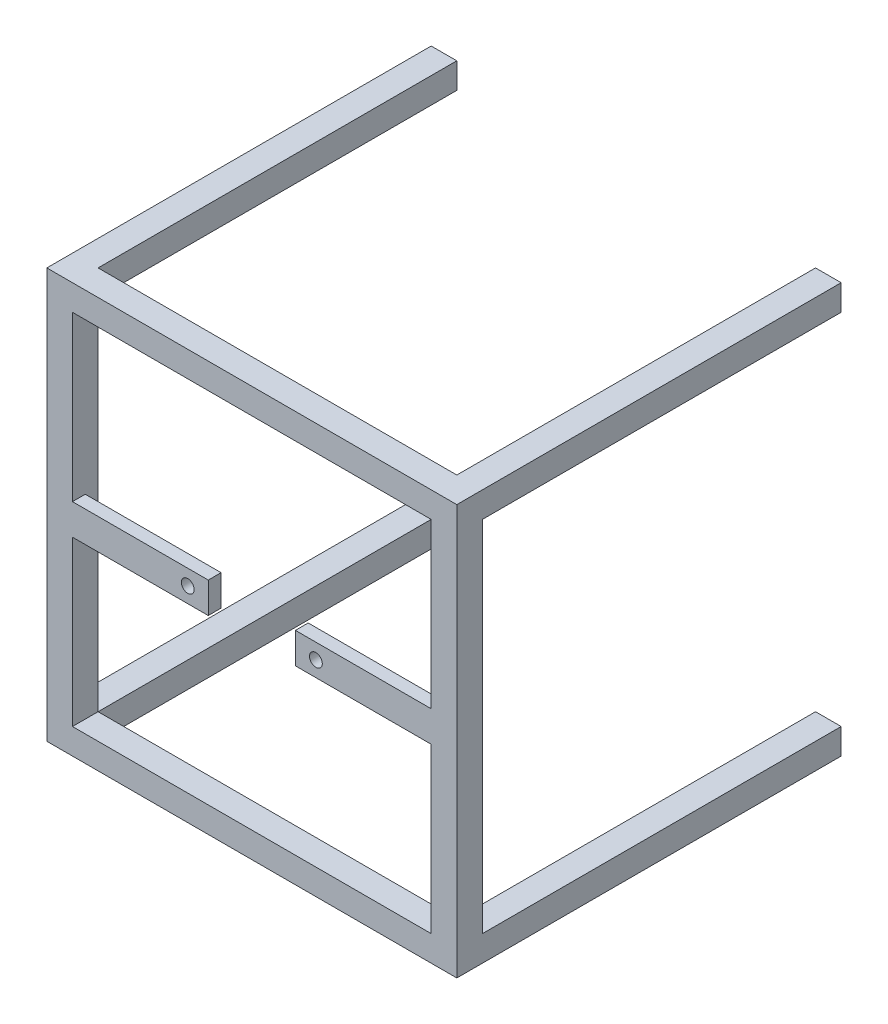
ISO-10303-21;
HEADER;
FILE_DESCRIPTION(('STEP AP214'),'2;1');
FILE_NAME('part.step','',(''),(''),'','','');
FILE_SCHEMA(('AUTOMOTIVE_DESIGN { 1 0 10303 214 1 1 1 1 }'));
ENDSEC;
DATA;
#1=APPLICATION_CONTEXT('core data for automotive mechanical design processes');
#2=APPLICATION_PROTOCOL_DEFINITION('international standard','automotive_design',2000,#1);
#3=PRODUCT_CONTEXT('',#1,'mechanical');
#4=PRODUCT('Part','Part','',(#3));
#5=PRODUCT_RELATED_PRODUCT_CATEGORY('part','',(#4));
#6=PRODUCT_DEFINITION_FORMATION('','',#4);
#7=PRODUCT_DEFINITION_CONTEXT('part definition',#1,'design');
#8=PRODUCT_DEFINITION('design','',#6,#7);
#9=PRODUCT_DEFINITION_SHAPE('','',#8);
#10=(LENGTH_UNIT() NAMED_UNIT(*) SI_UNIT(.MILLI.,.METRE.));
#11=(NAMED_UNIT(*) PLANE_ANGLE_UNIT() SI_UNIT($,.RADIAN.));
#12=(NAMED_UNIT(*) SI_UNIT($,.STERADIAN.) SOLID_ANGLE_UNIT());
#13=UNCERTAINTY_MEASURE_WITH_UNIT(LENGTH_MEASURE(1.E-05),#10,'distance_accuracy_value','');
#14=(GEOMETRIC_REPRESENTATION_CONTEXT(3) GLOBAL_UNCERTAINTY_ASSIGNED_CONTEXT((#13)) GLOBAL_UNIT_ASSIGNED_CONTEXT((#10,
#11,#12)) REPRESENTATION_CONTEXT('',''));
#15=CARTESIAN_POINT('',(0.,0.,0.));
#16=DIRECTION('',(0.,0.,1.));
#17=DIRECTION('',(1.,0.,0.));
#18=AXIS2_PLACEMENT_3D('',#15,#16,#17);
#19=CARTESIAN_POINT('',(0.,0.,10.));
#20=DIRECTION('',(1.,0.,0.));
#21=DIRECTION('',(0.,1.,0.));
#22=AXIS2_PLACEMENT_3D('',#19,#20,#21);
#23=PLANE('',#22);
#24=DIRECTION('',(0.,0.,-1.));
#25=VECTOR('',#24,1.);
#26=CARTESIAN_POINT('',(0.,0.,10.));
#27=LINE('',#26,#25);
#28=CARTESIAN_POINT('',(0.,0.,160.));
#29=VERTEX_POINT('',#28);
#30=CARTESIAN_POINT('',(0.,0.,10.));
#31=VERTEX_POINT('',#30);
#32=EDGE_CURVE('E248',#29,#31,#27,.T.);
#33=ORIENTED_EDGE('',*,*,#32,.T.);
#34=DIRECTION('',(0.,1.,0.));
#35=VECTOR('',#34,1.);
#36=CARTESIAN_POINT('',(0.,0.,10.));
#37=LINE('',#36,#35);
#38=CARTESIAN_POINT('',(0.,-10.,10.));
#39=VERTEX_POINT('',#38);
#40=EDGE_CURVE('E511',#39,#31,#37,.T.);
#41=ORIENTED_EDGE('',*,*,#40,.F.);
#42=DIRECTION('',(0.,0.,1.));
#43=VECTOR('',#42,1.);
#44=CARTESIAN_POINT('',(0.,-10.,0.));
#45=LINE('',#44,#43);
#46=CARTESIAN_POINT('',(0.,-10.,150.));
#47=VERTEX_POINT('',#46);
#48=EDGE_CURVE('E490',#39,#47,#45,.T.);
#49=ORIENTED_EDGE('',*,*,#48,.T.);
#50=DIRECTION('',(0.,-1.,0.));
#51=VECTOR('',#50,1.);
#52=CARTESIAN_POINT('',(0.,0.,150.));
#53=LINE('',#52,#51);
#54=CARTESIAN_POINT('',(0.,-150.,150.));
#55=VERTEX_POINT('',#54);
#56=EDGE_CURVE('E383',#47,#55,#53,.T.);
#57=ORIENTED_EDGE('',*,*,#56,.T.);
#58=DIRECTION('',(0.,0.,1.));
#59=VECTOR('',#58,1.);
#60=CARTESIAN_POINT('',(0.,-150.,0.));
#61=LINE('',#60,#59);
#62=CARTESIAN_POINT('',(0.,-150.,10.));
#63=VERTEX_POINT('',#62);
#64=EDGE_CURVE('E424',#63,#55,#61,.T.);
#65=ORIENTED_EDGE('',*,*,#64,.F.);
#66=CARTESIAN_POINT('',(0.,-160.,10.));
#67=VERTEX_POINT('',#66);
#68=EDGE_CURVE('E829',#67,#63,#37,.T.);
#69=ORIENTED_EDGE('',*,*,#68,.F.);
#70=DIRECTION('',(0.,0.,-1.));
#71=VECTOR('',#70,1.);
#72=CARTESIAN_POINT('',(0.,-160.,10.));
#73=LINE('',#72,#71);
#74=CARTESIAN_POINT('',(0.,-160.,160.));
#75=VERTEX_POINT('',#74);
#76=EDGE_CURVE('E240',#75,#67,#73,.T.);
#77=ORIENTED_EDGE('',*,*,#76,.F.);
#78=DIRECTION('',(0.,-1.,0.));
#79=VECTOR('',#78,1.);
#80=CARTESIAN_POINT('',(0.,0.,160.));
#81=LINE('',#80,#79);
#82=EDGE_CURVE('E384',#29,#75,#81,.T.);
#83=ORIENTED_EDGE('',*,*,#82,.F.);
#84=EDGE_LOOP('',(#33,#41,#49,#57,#65,#69,#77,#83));
#85=FACE_BOUND('',#84,.T.);
#86=ADVANCED_FACE('F39',(#85),#23,.F.);
#87=CARTESIAN_POINT('',(0.,-160.,10.));
#88=DIRECTION('',(0.,1.,0.));
#89=DIRECTION('',(0.,0.,1.));
#90=AXIS2_PLACEMENT_3D('',#87,#88,#89);
#91=PLANE('',#90);
#92=ORIENTED_EDGE('',*,*,#76,.T.);
#93=DIRECTION('',(-1.,0.,0.));
#94=VECTOR('',#93,1.);
#95=CARTESIAN_POINT('',(160.,-160.,10.));
#96=LINE('',#95,#94);
#97=CARTESIAN_POINT('',(10.,-160.,10.));
#98=VERTEX_POINT('',#97);
#99=EDGE_CURVE('E221',#98,#67,#96,.T.);
#100=ORIENTED_EDGE('',*,*,#99,.F.);
#101=DIRECTION('',(0.,0.,1.));
#102=VECTOR('',#101,1.);
#103=CARTESIAN_POINT('',(10.,-160.,0.));
#104=LINE('',#103,#102);
#105=CARTESIAN_POINT('',(10.,-160.,150.));
#106=VERTEX_POINT('',#105);
#107=EDGE_CURVE('E419',#98,#106,#104,.T.);
#108=ORIENTED_EDGE('',*,*,#107,.T.);
#109=DIRECTION('',(1.,0.,0.));
#110=VECTOR('',#109,1.);
#111=CARTESIAN_POINT('',(0.,-160.,150.));
#112=LINE('',#111,#110);
#113=CARTESIAN_POINT('',(150.,-160.,150.));
#114=VERTEX_POINT('',#113);
#115=EDGE_CURVE('E401',#106,#114,#112,.T.);
#116=ORIENTED_EDGE('',*,*,#115,.T.);
#117=DIRECTION('',(0.,0.,1.));
#118=VECTOR('',#117,1.);
#119=CARTESIAN_POINT('',(150.,-160.,0.));
#120=LINE('',#119,#118);
#121=CARTESIAN_POINT('',(150.,-160.,10.));
#122=VERTEX_POINT('',#121);
#123=EDGE_CURVE('E231',#122,#114,#120,.T.);
#124=ORIENTED_EDGE('',*,*,#123,.F.);
#125=CARTESIAN_POINT('',(160.,-160.,10.));
#126=VERTEX_POINT('',#125);
#127=EDGE_CURVE('E213',#126,#122,#96,.T.);
#128=ORIENTED_EDGE('',*,*,#127,.F.);
#129=DIRECTION('',(0.,0.,-1.));
#130=VECTOR('',#129,1.);
#131=CARTESIAN_POINT('',(160.,-160.,10.));
#132=LINE('',#131,#130);
#133=CARTESIAN_POINT('',(160.,-160.,160.));
#134=VERTEX_POINT('',#133);
#135=EDGE_CURVE('E228',#134,#126,#132,.T.);
#136=ORIENTED_EDGE('',*,*,#135,.F.);
#137=DIRECTION('',(1.,0.,0.));
#138=VECTOR('',#137,1.);
#139=CARTESIAN_POINT('',(0.,-160.,160.));
#140=LINE('',#139,#138);
#141=EDGE_CURVE('E387',#75,#134,#140,.T.);
#142=ORIENTED_EDGE('',*,*,#141,.F.);
#143=EDGE_LOOP('',(#92,#100,#108,#116,#124,#128,#136,#142));
#144=FACE_BOUND('',#143,.T.);
#145=ADVANCED_FACE('F226',(#144),#91,.F.);
#146=CARTESIAN_POINT('',(160.,0.,10.));
#147=DIRECTION('',(-1.,0.,0.));
#148=DIRECTION('',(0.,-1.,0.));
#149=AXIS2_PLACEMENT_3D('',#146,#147,#148);
#150=PLANE('',#149);
#151=ORIENTED_EDGE('',*,*,#135,.T.);
#152=DIRECTION('',(0.,1.,0.));
#153=VECTOR('',#152,1.);
#154=CARTESIAN_POINT('',(160.,0.,10.));
#155=LINE('',#154,#153);
#156=CARTESIAN_POINT('',(160.,-150.,10.));
#157=VERTEX_POINT('',#156);
#158=EDGE_CURVE('E209',#126,#157,#155,.T.);
#159=ORIENTED_EDGE('',*,*,#158,.T.);
#160=DIRECTION('',(0.,0.,1.));
#161=VECTOR('',#160,1.);
#162=CARTESIAN_POINT('',(160.,-150.,0.));
#163=LINE('',#162,#161);
#164=CARTESIAN_POINT('',(160.,-150.,150.));
#165=VERTEX_POINT('',#164);
#166=EDGE_CURVE('E446',#157,#165,#163,.T.);
#167=ORIENTED_EDGE('',*,*,#166,.T.);
#168=DIRECTION('',(0.,1.,0.));
#169=VECTOR('',#168,1.);
#170=CARTESIAN_POINT('',(160.,0.,150.));
#171=LINE('',#170,#169);
#172=CARTESIAN_POINT('',(160.,-10.,150.));
#173=VERTEX_POINT('',#172);
#174=EDGE_CURVE('E404',#165,#173,#171,.T.);
#175=ORIENTED_EDGE('',*,*,#174,.T.);
#176=DIRECTION('',(0.,0.,1.));
#177=VECTOR('',#176,1.);
#178=CARTESIAN_POINT('',(160.,-10.,0.));
#179=LINE('',#178,#177);
#180=CARTESIAN_POINT('',(160.,-10.,10.));
#181=VERTEX_POINT('',#180);
#182=EDGE_CURVE('E465',#181,#173,#179,.T.);
#183=ORIENTED_EDGE('',*,*,#182,.F.);
#184=CARTESIAN_POINT('',(160.,0.,10.));
#185=VERTEX_POINT('',#184);
#186=EDGE_CURVE('E222',#181,#185,#155,.T.);
#187=ORIENTED_EDGE('',*,*,#186,.T.);
#188=DIRECTION('',(0.,0.,-1.));
#189=VECTOR('',#188,1.);
#190=CARTESIAN_POINT('',(160.,0.,10.));
#191=LINE('',#190,#189);
#192=CARTESIAN_POINT('',(160.,0.,160.));
#193=VERTEX_POINT('',#192);
#194=EDGE_CURVE('E241',#193,#185,#191,.T.);
#195=ORIENTED_EDGE('',*,*,#194,.F.);
#196=DIRECTION('',(0.,1.,0.));
#197=VECTOR('',#196,1.);
#198=CARTESIAN_POINT('',(160.,0.,160.));
#199=LINE('',#198,#197);
#200=EDGE_CURVE('E238',#134,#193,#199,.T.);
#201=ORIENTED_EDGE('',*,*,#200,.F.);
#202=EDGE_LOOP('',(#151,#159,#167,#175,#183,#187,#195,#201));
#203=FACE_BOUND('',#202,.T.);
#204=ADVANCED_FACE('F236',(#203),#150,.F.);
#205=CARTESIAN_POINT('',(0.,0.,10.));
#206=DIRECTION('',(0.,-1.,0.));
#207=DIRECTION('',(0.,0.,-1.));
#208=AXIS2_PLACEMENT_3D('',#205,#206,#207);
#209=PLANE('',#208);
#210=ORIENTED_EDGE('',*,*,#194,.T.);
#211=DIRECTION('',(-1.,0.,0.));
#212=VECTOR('',#211,1.);
#213=CARTESIAN_POINT('',(160.,0.,10.));
#214=LINE('',#213,#212);
#215=CARTESIAN_POINT('',(150.,0.,10.));
#216=VERTEX_POINT('',#215);
#217=EDGE_CURVE('E523',#185,#216,#214,.T.);
#218=ORIENTED_EDGE('',*,*,#217,.T.);
#219=DIRECTION('',(0.,0.,1.));
#220=VECTOR('',#219,1.);
#221=CARTESIAN_POINT('',(150.,0.,0.));
#222=LINE('',#221,#220);
#223=CARTESIAN_POINT('',(150.,0.,150.));
#224=VERTEX_POINT('',#223);
#225=EDGE_CURVE('E464',#216,#224,#222,.T.);
#226=ORIENTED_EDGE('',*,*,#225,.T.);
#227=DIRECTION('',(-1.,0.,0.));
#228=VECTOR('',#227,1.);
#229=CARTESIAN_POINT('',(0.,0.,150.));
#230=LINE('',#229,#228);
#231=CARTESIAN_POINT('',(10.,0.,150.));
#232=VERTEX_POINT('',#231);
#233=EDGE_CURVE('E388',#224,#232,#230,.T.);
#234=ORIENTED_EDGE('',*,*,#233,.T.);
#235=DIRECTION('',(0.,0.,1.));
#236=VECTOR('',#235,1.);
#237=CARTESIAN_POINT('',(10.,0.,0.));
#238=LINE('',#237,#236);
#239=CARTESIAN_POINT('',(10.,0.,10.));
#240=VERTEX_POINT('',#239);
#241=EDGE_CURVE('E491',#240,#232,#238,.T.);
#242=ORIENTED_EDGE('',*,*,#241,.F.);
#243=EDGE_CURVE('E233',#240,#31,#214,.T.);
#244=ORIENTED_EDGE('',*,*,#243,.T.);
#245=ORIENTED_EDGE('',*,*,#32,.F.);
#246=DIRECTION('',(-1.,0.,0.));
#247=VECTOR('',#246,1.);
#248=CARTESIAN_POINT('',(0.,0.,160.));
#249=LINE('',#248,#247);
#250=EDGE_CURVE('E393',#193,#29,#249,.T.);
#251=ORIENTED_EDGE('',*,*,#250,.F.);
#252=EDGE_LOOP('',(#210,#218,#226,#234,#242,#244,#245,#251));
#253=FACE_BOUND('',#252,.T.);
#254=ADVANCED_FACE('F517',(#253),#209,.F.);
#255=CARTESIAN_POINT('',(10.,0.,0.));
#256=DIRECTION('',(1.,0.,0.));
#257=DIRECTION('',(0.,0.,-1.));
#258=AXIS2_PLACEMENT_3D('',#255,#256,#257);
#259=PLANE('',#258);
#260=DIRECTION('',(0.,0.,1.));
#261=VECTOR('',#260,1.);
#262=CARTESIAN_POINT('',(10.,-10.,0.));
#263=LINE('',#262,#261);
#264=CARTESIAN_POINT('',(10.,-10.,10.));
#265=VERTEX_POINT('',#264);
#266=CARTESIAN_POINT('',(10.,-10.,150.));
#267=VERTEX_POINT('',#266);
#268=EDGE_CURVE('E495',#265,#267,#263,.T.);
#269=ORIENTED_EDGE('',*,*,#268,.F.);
#270=DIRECTION('',(0.,1.,0.));
#271=VECTOR('',#270,1.);
#272=CARTESIAN_POINT('',(10.,0.,10.));
#273=LINE('',#272,#271);
#274=EDGE_CURVE('E503',#265,#240,#273,.T.);
#275=ORIENTED_EDGE('',*,*,#274,.T.);
#276=ORIENTED_EDGE('',*,*,#241,.T.);
#277=DIRECTION('',(0.,1.,0.));
#278=VECTOR('',#277,1.);
#279=CARTESIAN_POINT('',(10.,0.,150.));
#280=LINE('',#279,#278);
#281=EDGE_CURVE('E486',#267,#232,#280,.T.);
#282=ORIENTED_EDGE('',*,*,#281,.F.);
#283=EDGE_LOOP('',(#269,#275,#276,#282));
#284=FACE_BOUND('',#283,.T.);
#285=ADVANCED_FACE('F597',(#284),#259,.T.);
#286=CARTESIAN_POINT('',(0.,-10.,0.));
#287=DIRECTION('',(0.,-1.,0.));
#288=DIRECTION('',(0.,0.,-1.));
#289=AXIS2_PLACEMENT_3D('',#286,#287,#288);
#290=PLANE('',#289);
#291=DIRECTION('',(1.,0.,0.));
#292=VECTOR('',#291,1.);
#293=CARTESIAN_POINT('',(0.,-10.,10.));
#294=LINE('',#293,#292);
#295=EDGE_CURVE('E494',#39,#265,#294,.T.);
#296=ORIENTED_EDGE('',*,*,#295,.T.);
#297=ORIENTED_EDGE('',*,*,#268,.T.);
#298=DIRECTION('',(1.,0.,0.));
#299=VECTOR('',#298,1.);
#300=CARTESIAN_POINT('',(0.,-10.,150.));
#301=LINE('',#300,#299);
#302=EDGE_CURVE('E482',#47,#267,#301,.T.);
#303=ORIENTED_EDGE('',*,*,#302,.F.);
#304=ORIENTED_EDGE('',*,*,#48,.F.);
#305=EDGE_LOOP('',(#296,#297,#303,#304));
#306=FACE_BOUND('',#305,.T.);
#307=ADVANCED_FACE('F598',(#306),#290,.T.);
#308=CARTESIAN_POINT('',(160.,-10.,0.));
#309=DIRECTION('',(0.,-1.,0.));
#310=DIRECTION('',(1.,0.,0.));
#311=AXIS2_PLACEMENT_3D('',#308,#309,#310);
#312=PLANE('',#311);
#313=DIRECTION('',(0.,0.,1.));
#314=VECTOR('',#313,1.);
#315=CARTESIAN_POINT('',(150.,-10.,0.));
#316=LINE('',#315,#314);
#317=CARTESIAN_POINT('',(150.,-10.,10.));
#318=VERTEX_POINT('',#317);
#319=CARTESIAN_POINT('',(150.,-10.,150.));
#320=VERTEX_POINT('',#319);
#321=EDGE_CURVE('E469',#318,#320,#316,.T.);
#322=ORIENTED_EDGE('',*,*,#321,.F.);
#323=DIRECTION('',(1.,0.,0.));
#324=VECTOR('',#323,1.);
#325=CARTESIAN_POINT('',(0.,-10.,10.));
#326=LINE('',#325,#324);
#327=EDGE_CURVE('E478',#318,#181,#326,.T.);
#328=ORIENTED_EDGE('',*,*,#327,.T.);
#329=ORIENTED_EDGE('',*,*,#182,.T.);
#330=DIRECTION('',(1.,0.,0.));
#331=VECTOR('',#330,1.);
#332=CARTESIAN_POINT('',(160.,-10.,150.));
#333=LINE('',#332,#331);
#334=EDGE_CURVE('E460',#320,#173,#333,.T.);
#335=ORIENTED_EDGE('',*,*,#334,.F.);
#336=EDGE_LOOP('',(#322,#328,#329,#335));
#337=FACE_BOUND('',#336,.T.);
#338=ADVANCED_FACE('F601',(#337),#312,.T.);
#339=CARTESIAN_POINT('',(150.,0.,0.));
#340=DIRECTION('',(-1.,0.,0.));
#341=DIRECTION('',(0.,0.,1.));
#342=AXIS2_PLACEMENT_3D('',#339,#340,#341);
#343=PLANE('',#342);
#344=DIRECTION('',(0.,-1.,0.));
#345=VECTOR('',#344,1.);
#346=CARTESIAN_POINT('',(150.,0.,10.));
#347=LINE('',#346,#345);
#348=EDGE_CURVE('E468',#216,#318,#347,.T.);
#349=ORIENTED_EDGE('',*,*,#348,.T.);
#350=ORIENTED_EDGE('',*,*,#321,.T.);
#351=DIRECTION('',(0.,-1.,0.));
#352=VECTOR('',#351,1.);
#353=CARTESIAN_POINT('',(150.,0.,150.));
#354=LINE('',#353,#352);
#355=EDGE_CURVE('E456',#224,#320,#354,.T.);
#356=ORIENTED_EDGE('',*,*,#355,.F.);
#357=ORIENTED_EDGE('',*,*,#225,.F.);
#358=EDGE_LOOP('',(#349,#350,#356,#357));
#359=FACE_BOUND('',#358,.T.);
#360=ADVANCED_FACE('F531',(#359),#343,.T.);
#361=CARTESIAN_POINT('',(150.,-150.,0.));
#362=DIRECTION('',(-1.,0.,0.));
#363=DIRECTION('',(0.,0.,1.));
#364=AXIS2_PLACEMENT_3D('',#361,#362,#363);
#365=PLANE('',#364);
#366=DIRECTION('',(0.,-1.,0.));
#367=VECTOR('',#366,1.);
#368=CARTESIAN_POINT('',(150.,0.,10.));
#369=LINE('',#368,#367);
#370=CARTESIAN_POINT('',(150.,-150.,10.));
#371=VERTEX_POINT('',#370);
#372=EDGE_CURVE('E453',#371,#122,#369,.T.);
#373=ORIENTED_EDGE('',*,*,#372,.T.);
#374=ORIENTED_EDGE('',*,*,#123,.T.);
#375=DIRECTION('',(0.,-1.,0.));
#376=VECTOR('',#375,1.);
#377=CARTESIAN_POINT('',(150.,-150.,150.));
#378=LINE('',#377,#376);
#379=CARTESIAN_POINT('',(150.,-150.,150.));
#380=VERTEX_POINT('',#379);
#381=EDGE_CURVE('E435',#380,#114,#378,.T.);
#382=ORIENTED_EDGE('',*,*,#381,.F.);
#383=DIRECTION('',(0.,0.,1.));
#384=VECTOR('',#383,1.);
#385=CARTESIAN_POINT('',(150.,-150.,0.));
#386=LINE('',#385,#384);
#387=EDGE_CURVE('E443',#371,#380,#386,.T.);
#388=ORIENTED_EDGE('',*,*,#387,.F.);
#389=EDGE_LOOP('',(#373,#374,#382,#388));
#390=FACE_BOUND('',#389,.T.);
#391=ADVANCED_FACE('F608',(#390),#365,.T.);
#392=CARTESIAN_POINT('',(150.,-150.,0.));
#393=DIRECTION('',(0.,1.,0.));
#394=DIRECTION('',(0.,0.,1.));
#395=AXIS2_PLACEMENT_3D('',#392,#393,#394);
#396=PLANE('',#395);
#397=DIRECTION('',(-1.,0.,0.));
#398=VECTOR('',#397,1.);
#399=CARTESIAN_POINT('',(0.,-150.,10.));
#400=LINE('',#399,#398);
#401=EDGE_CURVE('E215',#157,#371,#400,.T.);
#402=ORIENTED_EDGE('',*,*,#401,.T.);
#403=ORIENTED_EDGE('',*,*,#387,.T.);
#404=DIRECTION('',(-1.,0.,0.));
#405=VECTOR('',#404,1.);
#406=CARTESIAN_POINT('',(150.,-150.,150.));
#407=LINE('',#406,#405);
#408=EDGE_CURVE('E439',#165,#380,#407,.T.);
#409=ORIENTED_EDGE('',*,*,#408,.F.);
#410=ORIENTED_EDGE('',*,*,#166,.F.);
#411=EDGE_LOOP('',(#402,#403,#409,#410));
#412=FACE_BOUND('',#411,.T.);
#413=ADVANCED_FACE('F614',(#412),#396,.T.);
#414=CARTESIAN_POINT('',(10.,-150.,0.));
#415=DIRECTION('',(1.,0.,0.));
#416=DIRECTION('',(0.,1.,0.));
#417=AXIS2_PLACEMENT_3D('',#414,#415,#416);
#418=PLANE('',#417);
#419=ORIENTED_EDGE('',*,*,#107,.F.);
#420=DIRECTION('',(0.,1.,0.));
#421=VECTOR('',#420,1.);
#422=CARTESIAN_POINT('',(9.99999999999999,0.,10.));
#423=LINE('',#422,#421);
#424=CARTESIAN_POINT('',(10.,-150.,10.));
#425=VERTEX_POINT('',#424);
#426=EDGE_CURVE('E431',#98,#425,#423,.T.);
#427=ORIENTED_EDGE('',*,*,#426,.T.);
#428=DIRECTION('',(0.,0.,1.));
#429=VECTOR('',#428,1.);
#430=CARTESIAN_POINT('',(10.,-150.,0.));
#431=LINE('',#430,#429);
#432=CARTESIAN_POINT('',(10.,-150.,150.));
#433=VERTEX_POINT('',#432);
#434=EDGE_CURVE('E418',#425,#433,#431,.T.);
#435=ORIENTED_EDGE('',*,*,#434,.T.);
#436=DIRECTION('',(0.,1.,0.));
#437=VECTOR('',#436,1.);
#438=CARTESIAN_POINT('',(10.,-150.,150.));
#439=LINE('',#438,#437);
#440=EDGE_CURVE('E397',#106,#433,#439,.T.);
#441=ORIENTED_EDGE('',*,*,#440,.F.);
#442=EDGE_LOOP('',(#419,#427,#435,#441));
#443=FACE_BOUND('',#442,.T.);
#444=ADVANCED_FACE('F618',(#443),#418,.T.);
#445=CARTESIAN_POINT('',(10.,-150.,0.));
#446=DIRECTION('',(0.,1.,0.));
#447=DIRECTION('',(0.,0.,1.));
#448=AXIS2_PLACEMENT_3D('',#445,#446,#447);
#449=PLANE('',#448);
#450=DIRECTION('',(-1.,0.,0.));
#451=VECTOR('',#450,1.);
#452=CARTESIAN_POINT('',(0.,-150.,10.));
#453=LINE('',#452,#451);
#454=EDGE_CURVE('E423',#425,#63,#453,.T.);
#455=ORIENTED_EDGE('',*,*,#454,.T.);
#456=ORIENTED_EDGE('',*,*,#64,.T.);
#457=DIRECTION('',(-1.,0.,0.));
#458=VECTOR('',#457,1.);
#459=CARTESIAN_POINT('',(10.,-150.,150.));
#460=LINE('',#459,#458);
#461=EDGE_CURVE('E414',#433,#55,#460,.T.);
#462=ORIENTED_EDGE('',*,*,#461,.F.);
#463=ORIENTED_EDGE('',*,*,#434,.F.);
#464=EDGE_LOOP('',(#455,#456,#462,#463));
#465=FACE_BOUND('',#464,.T.);
#466=ADVANCED_FACE('F621',(#465),#449,.T.);
#467=CARTESIAN_POINT('',(0.,0.,150.));
#468=DIRECTION('',(0.,0.,1.));
#469=DIRECTION('',(1.,0.,0.));
#470=AXIS2_PLACEMENT_3D('',#467,#468,#469);
#471=PLANE('',#470);
#472=ORIENTED_EDGE('',*,*,#281,.T.);
#473=ORIENTED_EDGE('',*,*,#233,.F.);
#474=ORIENTED_EDGE('',*,*,#355,.T.);
#475=DIRECTION('',(-1.,0.,0.));
#476=VECTOR('',#475,1.);
#477=CARTESIAN_POINT('',(10.,-10.,150.));
#478=LINE('',#477,#476);
#479=EDGE_CURVE('E364',#320,#267,#478,.T.);
#480=ORIENTED_EDGE('',*,*,#479,.T.);
#481=EDGE_LOOP('',(#472,#473,#474,#480));
#482=FACE_BOUND('',#481,.T.);
#483=ADVANCED_FACE('F535',(#482),#471,.F.);
#484=ORIENTED_EDGE('',*,*,#334,.T.);
#485=ORIENTED_EDGE('',*,*,#174,.F.);
#486=ORIENTED_EDGE('',*,*,#408,.T.);
#487=DIRECTION('',(0.,1.,0.));
#488=VECTOR('',#487,1.);
#489=CARTESIAN_POINT('',(150.,-10.,150.));
#490=LINE('',#489,#488);
#491=EDGE_CURVE('E360',#380,#320,#490,.T.);
#492=ORIENTED_EDGE('',*,*,#491,.T.);
#493=EDGE_LOOP('',(#484,#485,#486,#492));
#494=FACE_BOUND('',#493,.T.);
#495=ADVANCED_FACE('F546',(#494),#471,.F.);
#496=ORIENTED_EDGE('',*,*,#381,.T.);
#497=ORIENTED_EDGE('',*,*,#115,.F.);
#498=ORIENTED_EDGE('',*,*,#440,.T.);
#499=DIRECTION('',(1.,0.,0.));
#500=VECTOR('',#499,1.);
#501=CARTESIAN_POINT('',(10.,-150.,150.));
#502=LINE('',#501,#500);
#503=EDGE_CURVE('E356',#433,#380,#502,.T.);
#504=ORIENTED_EDGE('',*,*,#503,.T.);
#505=EDGE_LOOP('',(#496,#497,#498,#504));
#506=FACE_BOUND('',#505,.T.);
#507=ADVANCED_FACE('F630',(#506),#471,.F.);
#508=CARTESIAN_POINT('',(0.,0.,160.));
#509=DIRECTION('',(0.,0.,1.));
#510=DIRECTION('',(1.,0.,0.));
#511=AXIS2_PLACEMENT_3D('',#508,#509,#510);
#512=PLANE('',#511);
#513=DIRECTION('',(0.,1.,0.));
#514=VECTOR('',#513,1.);
#515=CARTESIAN_POINT('',(150.,-10.,160.));
#516=LINE('',#515,#514);
#517=CARTESIAN_POINT('',(150.,-74.,160.));
#518=VERTEX_POINT('',#517);
#519=CARTESIAN_POINT('',(150.,-10.,160.));
#520=VERTEX_POINT('',#519);
#521=EDGE_CURVE('E346',#518,#520,#516,.T.);
#522=ORIENTED_EDGE('',*,*,#521,.F.);
#523=DIRECTION('',(-1.,0.,0.));
#524=VECTOR('',#523,1.);
#525=CARTESIAN_POINT('',(97.,-74.,160.));
#526=LINE('',#525,#524);
#527=CARTESIAN_POINT('',(97.,-74.,160.));
#528=VERTEX_POINT('',#527);
#529=EDGE_CURVE('E283',#518,#528,#526,.T.);
#530=ORIENTED_EDGE('',*,*,#529,.T.);
#531=DIRECTION('',(0.,-1.,0.));
#532=VECTOR('',#531,1.);
#533=CARTESIAN_POINT('',(97.,-74.,160.));
#534=LINE('',#533,#532);
#535=CARTESIAN_POINT('',(97.,-86.,160.));
#536=VERTEX_POINT('',#535);
#537=EDGE_CURVE('E281',#528,#536,#534,.T.);
#538=ORIENTED_EDGE('',*,*,#537,.T.);
#539=DIRECTION('',(1.,0.,0.));
#540=VECTOR('',#539,1.);
#541=CARTESIAN_POINT('',(97.,-86.,160.));
#542=LINE('',#541,#540);
#543=CARTESIAN_POINT('',(150.,-86.,160.));
#544=VERTEX_POINT('',#543);
#545=EDGE_CURVE('E270',#536,#544,#542,.T.);
#546=ORIENTED_EDGE('',*,*,#545,.T.);
#547=CARTESIAN_POINT('',(150.,-150.,160.));
#548=VERTEX_POINT('',#547);
#549=EDGE_CURVE('E279',#548,#544,#516,.T.);
#550=ORIENTED_EDGE('',*,*,#549,.F.);
#551=DIRECTION('',(1.,0.,0.));
#552=VECTOR('',#551,1.);
#553=CARTESIAN_POINT('',(10.,-150.,160.));
#554=LINE('',#553,#552);
#555=CARTESIAN_POINT('',(10.,-150.,160.));
#556=VERTEX_POINT('',#555);
#557=EDGE_CURVE('E342',#556,#548,#554,.T.);
#558=ORIENTED_EDGE('',*,*,#557,.F.);
#559=DIRECTION('',(0.,-1.,0.));
#560=VECTOR('',#559,1.);
#561=CARTESIAN_POINT('',(10.,-10.,160.));
#562=LINE('',#561,#560);
#563=CARTESIAN_POINT('',(10.,-86.,160.));
#564=VERTEX_POINT('',#563);
#565=EDGE_CURVE('E343',#564,#556,#562,.T.);
#566=ORIENTED_EDGE('',*,*,#565,.F.);
#567=DIRECTION('',(1.,0.,0.));
#568=VECTOR('',#567,1.);
#569=CARTESIAN_POINT('',(63.,-86.,160.));
#570=LINE('',#569,#568);
#571=CARTESIAN_POINT('',(63.,-86.,160.));
#572=VERTEX_POINT('',#571);
#573=EDGE_CURVE('E315',#564,#572,#570,.T.);
#574=ORIENTED_EDGE('',*,*,#573,.T.);
#575=DIRECTION('',(0.,1.,0.));
#576=VECTOR('',#575,1.);
#577=CARTESIAN_POINT('',(63.,-74.,160.));
#578=LINE('',#577,#576);
#579=CARTESIAN_POINT('',(63.,-74.,160.));
#580=VERTEX_POINT('',#579);
#581=EDGE_CURVE('E306',#572,#580,#578,.T.);
#582=ORIENTED_EDGE('',*,*,#581,.T.);
#583=DIRECTION('',(-1.,0.,0.));
#584=VECTOR('',#583,1.);
#585=CARTESIAN_POINT('',(63.,-74.,160.));
#586=LINE('',#585,#584);
#587=CARTESIAN_POINT('',(10.,-74.,160.));
#588=VERTEX_POINT('',#587);
#589=EDGE_CURVE('E326',#580,#588,#586,.T.);
#590=ORIENTED_EDGE('',*,*,#589,.T.);
#591=CARTESIAN_POINT('',(10.,-10.,160.));
#592=VERTEX_POINT('',#591);
#593=EDGE_CURVE('E339',#592,#588,#562,.T.);
#594=ORIENTED_EDGE('',*,*,#593,.F.);
#595=DIRECTION('',(-1.,0.,0.));
#596=VECTOR('',#595,1.);
#597=CARTESIAN_POINT('',(10.,-10.,160.));
#598=LINE('',#597,#596);
#599=EDGE_CURVE('E349',#520,#592,#598,.T.);
#600=ORIENTED_EDGE('',*,*,#599,.F.);
#601=EDGE_LOOP('',(#522,#530,#538,#546,#550,#558,#566,#574,#582,#590,#594,#600));
#602=FACE_BOUND('',#601,.T.);
#603=ORIENTED_EDGE('',*,*,#200,.T.);
#604=ORIENTED_EDGE('',*,*,#250,.T.);
#605=ORIENTED_EDGE('',*,*,#82,.T.);
#606=ORIENTED_EDGE('',*,*,#141,.T.);
#607=EDGE_LOOP('',(#603,#604,#605,#606));
#608=FACE_BOUND('',#607,.T.);
#609=CARTESIAN_POINT('',(55.,-80.,160.));
#610=DIRECTION('',(0.,0.,1.));
#611=DIRECTION('',(1.,0.,0.));
#612=AXIS2_PLACEMENT_3D('',#609,#610,#611);
#613=CIRCLE('',#612,2.5);
#614=CARTESIAN_POINT('',(57.5,-80.,160.));
#615=VERTEX_POINT('',#614);
#616=EDGE_CURVE('E297',#615,#615,#613,.T.);
#617=ORIENTED_EDGE('',*,*,#616,.F.);
#618=EDGE_LOOP('',(#617));
#619=FACE_BOUND('',#618,.T.);
#620=CARTESIAN_POINT('',(105.,-80.,160.));
#621=DIRECTION('',(0.,0.,1.));
#622=DIRECTION('',(-1.,0.,0.));
#623=AXIS2_PLACEMENT_3D('',#620,#621,#622);
#624=CIRCLE('',#623,2.5);
#625=CARTESIAN_POINT('',(102.5,-80.,160.));
#626=VERTEX_POINT('',#625);
#627=EDGE_CURVE('E528',#626,#626,#624,.T.);
#628=ORIENTED_EDGE('',*,*,#627,.F.);
#629=EDGE_LOOP('',(#628));
#630=FACE_BOUND('',#629,.T.);
#631=ADVANCED_FACE('F276',(#602,#608,#619,#630),#512,.T.);
#632=ORIENTED_EDGE('',*,*,#302,.T.);
#633=DIRECTION('',(0.,-1.,0.));
#634=VECTOR('',#633,1.);
#635=CARTESIAN_POINT('',(10.,-10.,150.));
#636=LINE('',#635,#634);
#637=EDGE_CURVE('E336',#267,#433,#636,.T.);
#638=ORIENTED_EDGE('',*,*,#637,.T.);
#639=ORIENTED_EDGE('',*,*,#461,.T.);
#640=ORIENTED_EDGE('',*,*,#56,.F.);
#641=EDGE_LOOP('',(#632,#638,#639,#640));
#642=FACE_BOUND('',#641,.T.);
#643=ADVANCED_FACE('F626',(#642),#471,.F.);
#644=CARTESIAN_POINT('',(10.,-10.,160.));
#645=DIRECTION('',(1.,0.,0.));
#646=DIRECTION('',(0.,1.,0.));
#647=AXIS2_PLACEMENT_3D('',#644,#645,#646);
#648=PLANE('',#647);
#649=DIRECTION('',(0.,0.,-1.));
#650=VECTOR('',#649,1.);
#651=CARTESIAN_POINT('',(10.,-86.,160.));
#652=LINE('',#651,#650);
#653=CARTESIAN_POINT('',(10.,-86.,155.));
#654=VERTEX_POINT('',#653);
#655=EDGE_CURVE('E259',#564,#654,#652,.T.);
#656=ORIENTED_EDGE('',*,*,#655,.F.);
#657=ORIENTED_EDGE('',*,*,#565,.T.);
#658=DIRECTION('',(0.,0.,-1.));
#659=VECTOR('',#658,1.);
#660=CARTESIAN_POINT('',(10.,-150.,160.));
#661=LINE('',#660,#659);
#662=EDGE_CURVE('E379',#556,#433,#661,.T.);
#663=ORIENTED_EDGE('',*,*,#662,.T.);
#664=ORIENTED_EDGE('',*,*,#637,.F.);
#665=DIRECTION('',(0.,0.,-1.));
#666=VECTOR('',#665,1.);
#667=CARTESIAN_POINT('',(10.,-10.,160.));
#668=LINE('',#667,#666);
#669=EDGE_CURVE('E352',#592,#267,#668,.T.);
#670=ORIENTED_EDGE('',*,*,#669,.F.);
#671=ORIENTED_EDGE('',*,*,#593,.T.);
#672=DIRECTION('',(0.,0.,1.));
#673=VECTOR('',#672,1.);
#674=CARTESIAN_POINT('',(10.,-74.,160.));
#675=LINE('',#674,#673);
#676=CARTESIAN_POINT('',(10.,-74.,155.));
#677=VERTEX_POINT('',#676);
#678=EDGE_CURVE('E255',#677,#588,#675,.T.);
#679=ORIENTED_EDGE('',*,*,#678,.F.);
#680=DIRECTION('',(0.,1.,0.));
#681=VECTOR('',#680,1.);
#682=CARTESIAN_POINT('',(10.,-10.,155.));
#683=LINE('',#682,#681);
#684=EDGE_CURVE('E245',#654,#677,#683,.T.);
#685=ORIENTED_EDGE('',*,*,#684,.F.);
#686=EDGE_LOOP('',(#656,#657,#663,#664,#670,#671,#679,#685));
#687=FACE_BOUND('',#686,.T.);
#688=ADVANCED_FACE('F557',(#687),#648,.T.);
#689=CARTESIAN_POINT('',(10.,-150.,160.));
#690=DIRECTION('',(0.,1.,0.));
#691=DIRECTION('',(0.,0.,1.));
#692=AXIS2_PLACEMENT_3D('',#689,#690,#691);
#693=PLANE('',#692);
#694=ORIENTED_EDGE('',*,*,#503,.F.);
#695=ORIENTED_EDGE('',*,*,#662,.F.);
#696=ORIENTED_EDGE('',*,*,#557,.T.);
#697=DIRECTION('',(0.,0.,-1.));
#698=VECTOR('',#697,1.);
#699=CARTESIAN_POINT('',(150.,-150.,160.));
#700=LINE('',#699,#698);
#701=EDGE_CURVE('E375',#548,#380,#700,.T.);
#702=ORIENTED_EDGE('',*,*,#701,.T.);
#703=EDGE_LOOP('',(#694,#695,#696,#702));
#704=FACE_BOUND('',#703,.T.);
#705=ADVANCED_FACE('F551',(#704),#693,.T.);
#706=CARTESIAN_POINT('',(150.,-10.,160.));
#707=DIRECTION('',(-1.,0.,0.));
#708=DIRECTION('',(0.,-1.,0.));
#709=AXIS2_PLACEMENT_3D('',#706,#707,#708);
#710=PLANE('',#709);
#711=DIRECTION('',(0.,0.,-1.));
#712=VECTOR('',#711,1.);
#713=CARTESIAN_POINT('',(150.,-74.,160.));
#714=LINE('',#713,#712);
#715=CARTESIAN_POINT('',(150.,-74.,155.));
#716=VERTEX_POINT('',#715);
#717=EDGE_CURVE('E11',#518,#716,#714,.T.);
#718=ORIENTED_EDGE('',*,*,#717,.F.);
#719=ORIENTED_EDGE('',*,*,#521,.T.);
#720=DIRECTION('',(0.,0.,-1.));
#721=VECTOR('',#720,1.);
#722=CARTESIAN_POINT('',(150.,-10.,160.));
#723=LINE('',#722,#721);
#724=EDGE_CURVE('E371',#520,#320,#723,.T.);
#725=ORIENTED_EDGE('',*,*,#724,.T.);
#726=ORIENTED_EDGE('',*,*,#491,.F.);
#727=ORIENTED_EDGE('',*,*,#701,.F.);
#728=ORIENTED_EDGE('',*,*,#549,.T.);
#729=DIRECTION('',(0.,0.,1.));
#730=VECTOR('',#729,1.);
#731=CARTESIAN_POINT('',(150.,-86.,160.));
#732=LINE('',#731,#730);
#733=CARTESIAN_POINT('',(150.,-86.,155.));
#734=VERTEX_POINT('',#733);
#735=EDGE_CURVE('E47',#734,#544,#732,.T.);
#736=ORIENTED_EDGE('',*,*,#735,.F.);
#737=DIRECTION('',(0.,1.,0.));
#738=VECTOR('',#737,1.);
#739=CARTESIAN_POINT('',(150.,-10.,155.));
#740=LINE('',#739,#738);
#741=EDGE_CURVE('E54',#734,#716,#740,.T.);
#742=ORIENTED_EDGE('',*,*,#741,.T.);
#743=EDGE_LOOP('',(#718,#719,#725,#726,#727,#728,#736,#742));
#744=FACE_BOUND('',#743,.T.);
#745=ADVANCED_FACE('F539',(#744),#710,.T.);
#746=CARTESIAN_POINT('',(10.,-10.,160.));
#747=DIRECTION('',(0.,-1.,0.));
#748=DIRECTION('',(0.,0.,-1.));
#749=AXIS2_PLACEMENT_3D('',#746,#747,#748);
#750=PLANE('',#749);
#751=ORIENTED_EDGE('',*,*,#479,.F.);
#752=ORIENTED_EDGE('',*,*,#724,.F.);
#753=ORIENTED_EDGE('',*,*,#599,.T.);
#754=ORIENTED_EDGE('',*,*,#669,.T.);
#755=EDGE_LOOP('',(#751,#752,#753,#754));
#756=FACE_BOUND('',#755,.T.);
#757=ADVANCED_FACE('F543',(#756),#750,.T.);
#758=CARTESIAN_POINT('',(63.,-74.,155.));
#759=DIRECTION('',(1.,0.,0.));
#760=DIRECTION('',(0.,0.,-1.));
#761=AXIS2_PLACEMENT_3D('',#758,#759,#760);
#762=PLANE('',#761);
#763=ORIENTED_EDGE('',*,*,#581,.F.);
#764=DIRECTION('',(0.,0.,1.));
#765=VECTOR('',#764,1.);
#766=CARTESIAN_POINT('',(63.,-86.,155.));
#767=LINE('',#766,#765);
#768=CARTESIAN_POINT('',(63.,-86.,155.));
#769=VERTEX_POINT('',#768);
#770=EDGE_CURVE('E332',#769,#572,#767,.T.);
#771=ORIENTED_EDGE('',*,*,#770,.F.);
#772=DIRECTION('',(0.,1.,0.));
#773=VECTOR('',#772,1.);
#774=CARTESIAN_POINT('',(63.,-74.,155.));
#775=LINE('',#774,#773);
#776=CARTESIAN_POINT('',(63.,-74.,155.));
#777=VERTEX_POINT('',#776);
#778=EDGE_CURVE('E310',#769,#777,#775,.T.);
#779=ORIENTED_EDGE('',*,*,#778,.T.);
#780=DIRECTION('',(0.,0.,1.));
#781=VECTOR('',#780,1.);
#782=CARTESIAN_POINT('',(63.,-74.,155.));
#783=LINE('',#782,#781);
#784=EDGE_CURVE('E322',#777,#580,#783,.T.);
#785=ORIENTED_EDGE('',*,*,#784,.T.);
#786=EDGE_LOOP('',(#763,#771,#779,#785));
#787=FACE_BOUND('',#786,.T.);
#788=ADVANCED_FACE('F565',(#787),#762,.T.);
#789=CARTESIAN_POINT('',(63.,-86.,155.));
#790=DIRECTION('',(0.,-1.,0.));
#791=DIRECTION('',(1.,0.,0.));
#792=AXIS2_PLACEMENT_3D('',#789,#790,#791);
#793=PLANE('',#792);
#794=ORIENTED_EDGE('',*,*,#573,.F.);
#795=ORIENTED_EDGE('',*,*,#655,.T.);
#796=DIRECTION('',(1.,0.,0.));
#797=VECTOR('',#796,1.);
#798=CARTESIAN_POINT('',(63.,-86.,155.));
#799=LINE('',#798,#797);
#800=EDGE_CURVE('E319',#654,#769,#799,.T.);
#801=ORIENTED_EDGE('',*,*,#800,.T.);
#802=ORIENTED_EDGE('',*,*,#770,.T.);
#803=EDGE_LOOP('',(#794,#795,#801,#802));
#804=FACE_BOUND('',#803,.T.);
#805=ADVANCED_FACE('F560',(#804),#793,.T.);
#806=CARTESIAN_POINT('',(63.,-74.,155.));
#807=DIRECTION('',(0.,1.,0.));
#808=DIRECTION('',(-1.,0.,0.));
#809=AXIS2_PLACEMENT_3D('',#806,#807,#808);
#810=PLANE('',#809);
#811=DIRECTION('',(-1.,0.,0.));
#812=VECTOR('',#811,1.);
#813=CARTESIAN_POINT('',(63.,-74.,155.));
#814=LINE('',#813,#812);
#815=EDGE_CURVE('E314',#777,#677,#814,.T.);
#816=ORIENTED_EDGE('',*,*,#815,.T.);
#817=ORIENTED_EDGE('',*,*,#678,.T.);
#818=ORIENTED_EDGE('',*,*,#589,.F.);
#819=ORIENTED_EDGE('',*,*,#784,.F.);
#820=EDGE_LOOP('',(#816,#817,#818,#819));
#821=FACE_BOUND('',#820,.T.);
#822=ADVANCED_FACE('F569',(#821),#810,.T.);
#823=CARTESIAN_POINT('',(0.,0.,155.));
#824=DIRECTION('',(0.,0.,-1.));
#825=DIRECTION('',(-1.,0.,0.));
#826=AXIS2_PLACEMENT_3D('',#823,#824,#825);
#827=PLANE('',#826);
#828=CARTESIAN_POINT('',(55.,-80.,155.));
#829=DIRECTION('',(0.,0.,1.));
#830=DIRECTION('',(1.,0.,0.));
#831=AXIS2_PLACEMENT_3D('',#828,#829,#830);
#832=CIRCLE('',#831,2.5);
#833=CARTESIAN_POINT('',(57.5,-80.,155.));
#834=VERTEX_POINT('',#833);
#835=EDGE_CURVE('E302',#834,#834,#832,.T.);
#836=ORIENTED_EDGE('',*,*,#835,.T.);
#837=EDGE_LOOP('',(#836));
#838=FACE_BOUND('',#837,.T.);
#839=ORIENTED_EDGE('',*,*,#800,.F.);
#840=ORIENTED_EDGE('',*,*,#684,.T.);
#841=ORIENTED_EDGE('',*,*,#815,.F.);
#842=ORIENTED_EDGE('',*,*,#778,.F.);
#843=EDGE_LOOP('',(#839,#840,#841,#842));
#844=FACE_BOUND('',#843,.T.);
#845=ADVANCED_FACE('F572',(#838,#844),#827,.T.);
#846=CARTESIAN_POINT('',(55.,-80.,155.));
#847=DIRECTION('',(0.,0.,1.));
#848=DIRECTION('',(1.,0.,0.));
#849=AXIS2_PLACEMENT_3D('',#846,#847,#848);
#850=CYLINDRICAL_SURFACE('',#849,2.5);
#851=ORIENTED_EDGE('',*,*,#835,.F.);
#852=EDGE_LOOP('',(#851));
#853=FACE_BOUND('',#852,.T.);
#854=ORIENTED_EDGE('',*,*,#616,.T.);
#855=EDGE_LOOP('',(#854));
#856=FACE_BOUND('',#855,.T.);
#857=ADVANCED_FACE('F574',(#853,#856),#850,.F.);
#858=CARTESIAN_POINT('',(97.,-74.,155.));
#859=DIRECTION('',(-1.,0.,0.));
#860=DIRECTION('',(0.,0.,1.));
#861=AXIS2_PLACEMENT_3D('',#858,#859,#860);
#862=PLANE('',#861);
#863=ORIENTED_EDGE('',*,*,#537,.F.);
#864=DIRECTION('',(0.,0.,1.));
#865=VECTOR('',#864,1.);
#866=CARTESIAN_POINT('',(97.,-74.,155.));
#867=LINE('',#866,#865);
#868=CARTESIAN_POINT('',(97.,-74.,155.));
#869=VERTEX_POINT('',#868);
#870=EDGE_CURVE('E293',#869,#528,#867,.T.);
#871=ORIENTED_EDGE('',*,*,#870,.F.);
#872=DIRECTION('',(0.,-1.,0.));
#873=VECTOR('',#872,1.);
#874=CARTESIAN_POINT('',(97.,-74.,155.));
#875=LINE('',#874,#873);
#876=CARTESIAN_POINT('',(97.,-86.,155.));
#877=VERTEX_POINT('',#876);
#878=EDGE_CURVE('E287',#869,#877,#875,.T.);
#879=ORIENTED_EDGE('',*,*,#878,.T.);
#880=DIRECTION('',(0.,0.,1.));
#881=VECTOR('',#880,1.);
#882=CARTESIAN_POINT('',(97.,-86.,155.));
#883=LINE('',#882,#881);
#884=EDGE_CURVE('E298',#877,#536,#883,.T.);
#885=ORIENTED_EDGE('',*,*,#884,.T.);
#886=EDGE_LOOP('',(#863,#871,#879,#885));
#887=FACE_BOUND('',#886,.T.);
#888=ADVANCED_FACE('F581',(#887),#862,.T.);
#889=CARTESIAN_POINT('',(97.,-74.,155.));
#890=DIRECTION('',(0.,1.,0.));
#891=DIRECTION('',(-1.,0.,0.));
#892=AXIS2_PLACEMENT_3D('',#889,#890,#891);
#893=PLANE('',#892);
#894=ORIENTED_EDGE('',*,*,#529,.F.);
#895=ORIENTED_EDGE('',*,*,#717,.T.);
#896=DIRECTION('',(-1.,0.,0.));
#897=VECTOR('',#896,1.);
#898=CARTESIAN_POINT('',(97.,-74.,155.));
#899=LINE('',#898,#897);
#900=EDGE_CURVE('E301',#716,#869,#899,.T.);
#901=ORIENTED_EDGE('',*,*,#900,.T.);
#902=ORIENTED_EDGE('',*,*,#870,.T.);
#903=EDGE_LOOP('',(#894,#895,#901,#902));
#904=FACE_BOUND('',#903,.T.);
#905=ADVANCED_FACE('F670',(#904),#893,.T.);
#906=CARTESIAN_POINT('',(97.,-86.,155.));
#907=DIRECTION('',(0.,-1.,0.));
#908=DIRECTION('',(1.,0.,0.));
#909=AXIS2_PLACEMENT_3D('',#906,#907,#908);
#910=PLANE('',#909);
#911=DIRECTION('',(1.,0.,0.));
#912=VECTOR('',#911,1.);
#913=CARTESIAN_POINT('',(97.,-86.,155.));
#914=LINE('',#913,#912);
#915=EDGE_CURVE('E273',#877,#734,#914,.T.);
#916=ORIENTED_EDGE('',*,*,#915,.T.);
#917=ORIENTED_EDGE('',*,*,#735,.T.);
#918=ORIENTED_EDGE('',*,*,#545,.F.);
#919=ORIENTED_EDGE('',*,*,#884,.F.);
#920=EDGE_LOOP('',(#916,#917,#918,#919));
#921=FACE_BOUND('',#920,.T.);
#922=ADVANCED_FACE('F269',(#921),#910,.T.);
#923=CARTESIAN_POINT('',(0.,0.,155.));
#924=DIRECTION('',(0.,0.,1.));
#925=DIRECTION('',(1.,0.,0.));
#926=AXIS2_PLACEMENT_3D('',#923,#924,#925);
#927=PLANE('',#926);
#928=ORIENTED_EDGE('',*,*,#741,.F.);
#929=ORIENTED_EDGE('',*,*,#915,.F.);
#930=ORIENTED_EDGE('',*,*,#878,.F.);
#931=ORIENTED_EDGE('',*,*,#900,.F.);
#932=EDGE_LOOP('',(#928,#929,#930,#931));
#933=FACE_BOUND('',#932,.T.);
#934=CARTESIAN_POINT('',(105.,-80.,155.));
#935=DIRECTION('',(0.,0.,1.));
#936=DIRECTION('',(-1.,0.,0.));
#937=AXIS2_PLACEMENT_3D('',#934,#935,#936);
#938=CIRCLE('',#937,2.5);
#939=CARTESIAN_POINT('',(102.5,-80.,155.));
#940=VERTEX_POINT('',#939);
#941=EDGE_CURVE('E289',#940,#940,#938,.T.);
#942=ORIENTED_EDGE('',*,*,#941,.T.);
#943=EDGE_LOOP('',(#942));
#944=FACE_BOUND('',#943,.T.);
#945=ADVANCED_FACE('F689',(#933,#944),#927,.F.);
#946=CARTESIAN_POINT('',(105.,-80.,155.));
#947=DIRECTION('',(0.,0.,1.));
#948=DIRECTION('',(1.,0.,0.));
#949=AXIS2_PLACEMENT_3D('',#946,#947,#948);
#950=CYLINDRICAL_SURFACE('',#949,2.5);
#951=ORIENTED_EDGE('',*,*,#941,.F.);
#952=EDGE_LOOP('',(#951));
#953=FACE_BOUND('',#952,.T.);
#954=ORIENTED_EDGE('',*,*,#627,.T.);
#955=EDGE_LOOP('',(#954));
#956=FACE_BOUND('',#955,.T.);
#957=ADVANCED_FACE('F698',(#953,#956),#950,.F.);
#958=CARTESIAN_POINT('',(160.,0.,10.));
#959=DIRECTION('',(0.,0.,1.));
#960=DIRECTION('',(1.,0.,0.));
#961=AXIS2_PLACEMENT_3D('',#958,#959,#960);
#962=PLANE('',#961);
#963=ORIENTED_EDGE('',*,*,#426,.F.);
#964=ORIENTED_EDGE('',*,*,#99,.T.);
#965=ORIENTED_EDGE('',*,*,#68,.T.);
#966=ORIENTED_EDGE('',*,*,#454,.F.);
#967=EDGE_LOOP('',(#963,#964,#965,#966));
#968=FACE_BOUND('',#967,.T.);
#969=ADVANCED_FACE('F707',(#968),#962,.F.);
#970=ORIENTED_EDGE('',*,*,#127,.T.);
#971=ORIENTED_EDGE('',*,*,#372,.F.);
#972=ORIENTED_EDGE('',*,*,#401,.F.);
#973=ORIENTED_EDGE('',*,*,#158,.F.);
#974=EDGE_LOOP('',(#970,#971,#972,#973));
#975=FACE_BOUND('',#974,.T.);
#976=ADVANCED_FACE('F211',(#975),#962,.F.);
#977=ORIENTED_EDGE('',*,*,#327,.F.);
#978=ORIENTED_EDGE('',*,*,#348,.F.);
#979=ORIENTED_EDGE('',*,*,#217,.F.);
#980=ORIENTED_EDGE('',*,*,#186,.F.);
#981=EDGE_LOOP('',(#977,#978,#979,#980));
#982=FACE_BOUND('',#981,.T.);
#983=ADVANCED_FACE('F794',(#982),#962,.F.);
#984=ORIENTED_EDGE('',*,*,#274,.F.);
#985=ORIENTED_EDGE('',*,*,#295,.F.);
#986=ORIENTED_EDGE('',*,*,#40,.T.);
#987=ORIENTED_EDGE('',*,*,#243,.F.);
#988=EDGE_LOOP('',(#984,#985,#986,#987));
#989=FACE_BOUND('',#988,.T.);
#990=ADVANCED_FACE('F802',(#989),#962,.F.);
#991=CLOSED_SHELL('',(#86,#145,#204,#254,#285,#307,#338,#360,#391,#413,#444,#466,#483,#495,#507,
#631,#643,#688,#705,#745,#757,#788,#805,#822,#845,#857,#888,#905,#922,#945,#957,#969,#976,#983,#990));
#992=MANIFOLD_SOLID_BREP('B2',#991);
#993=ADVANCED_BREP_SHAPE_REPRESENTATION('',(#18,#992),#14);
#994=SHAPE_DEFINITION_REPRESENTATION(#9,#993);
ENDSEC;
END-ISO-10303-21;
